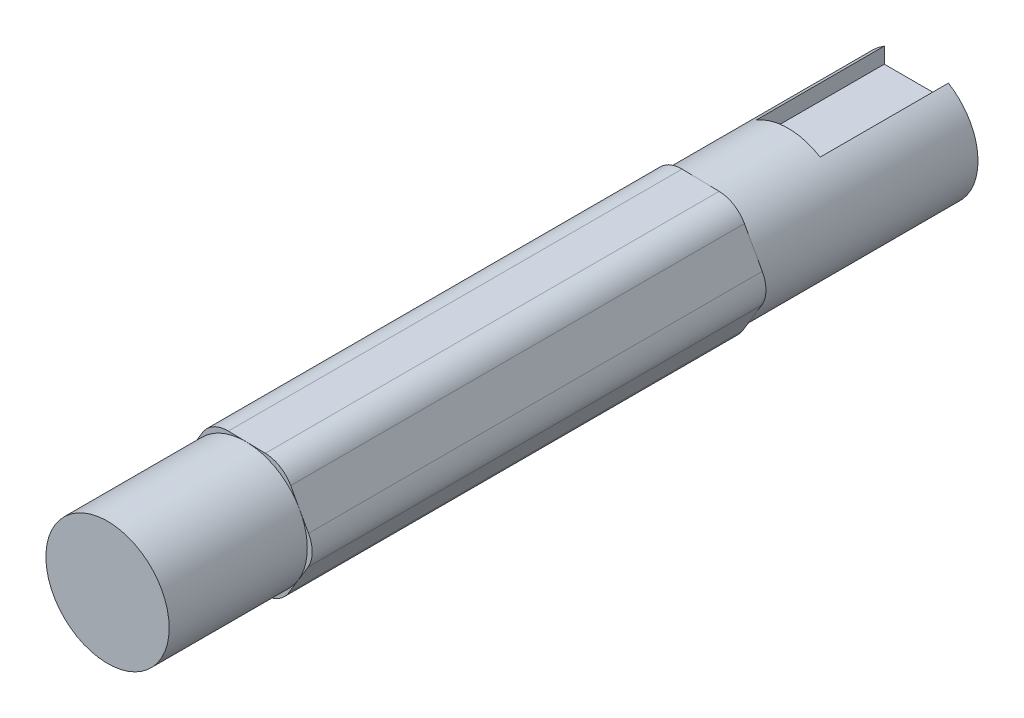
ISO-10303-21;
HEADER;
FILE_DESCRIPTION(('STEP AP214'),'2;1');
FILE_NAME('part.step','',(''),(''),'','','');
FILE_SCHEMA(('AUTOMOTIVE_DESIGN { 1 0 10303 214 1 1 1 1 }'));
ENDSEC;
DATA;
#1=APPLICATION_CONTEXT('core data for automotive mechanical design processes');
#2=APPLICATION_PROTOCOL_DEFINITION('international standard','automotive_design',2000,#1);
#3=PRODUCT_CONTEXT('',#1,'mechanical');
#4=PRODUCT('Part','Part','',(#3));
#5=PRODUCT_RELATED_PRODUCT_CATEGORY('part','',(#4));
#6=PRODUCT_DEFINITION_FORMATION('','',#4);
#7=PRODUCT_DEFINITION_CONTEXT('part definition',#1,'design');
#8=PRODUCT_DEFINITION('design','',#6,#7);
#9=PRODUCT_DEFINITION_SHAPE('','',#8);
#10=(LENGTH_UNIT() NAMED_UNIT(*) SI_UNIT(.MILLI.,.METRE.));
#11=(NAMED_UNIT(*) PLANE_ANGLE_UNIT() SI_UNIT($,.RADIAN.));
#12=(NAMED_UNIT(*) SI_UNIT($,.STERADIAN.) SOLID_ANGLE_UNIT());
#13=UNCERTAINTY_MEASURE_WITH_UNIT(LENGTH_MEASURE(1.E-05),#10,'distance_accuracy_value','');
#14=(GEOMETRIC_REPRESENTATION_CONTEXT(3) GLOBAL_UNCERTAINTY_ASSIGNED_CONTEXT((#13)) GLOBAL_UNIT_ASSIGNED_CONTEXT((#10,
#11,#12)) REPRESENTATION_CONTEXT('',''));
#15=CARTESIAN_POINT('',(0.,0.,0.));
#16=DIRECTION('',(0.,0.,1.));
#17=DIRECTION('',(1.,0.,0.));
#18=AXIS2_PLACEMENT_3D('',#15,#16,#17);
#19=CARTESIAN_POINT('',(0.,0.,-45.));
#20=DIRECTION('',(0.,0.,1.));
#21=DIRECTION('',(1.,0.,0.));
#22=AXIS2_PLACEMENT_3D('',#19,#20,#21);
#23=CYLINDRICAL_SURFACE('',#22,6.25);
#24=DIRECTION('',(0.,0.,1.));
#25=VECTOR('',#24,1.);
#26=CARTESIAN_POINT('',(3.25,5.33853912601566,-45.));
#27=LINE('',#26,#25);
#28=CARTESIAN_POINT('',(3.25,5.33853912601566,-32.));
#29=VERTEX_POINT('',#28);
#30=CARTESIAN_POINT('',(3.25,5.33853912601566,-45.));
#31=VERTEX_POINT('',#30);
#32=EDGE_CURVE('E268',#29,#31,#27,.F.);
#33=ORIENTED_EDGE('',*,*,#32,.F.);
#34=CARTESIAN_POINT('',(0.,0.,-32.));
#35=DIRECTION('',(0.,0.,-1.));
#36=DIRECTION('',(-1.,0.,0.));
#37=AXIS2_PLACEMENT_3D('',#34,#35,#36);
#38=CIRCLE('',#37,6.25);
#39=CARTESIAN_POINT('',(-3.25,5.33853912601566,-32.));
#40=VERTEX_POINT('',#39);
#41=EDGE_CURVE('E228',#29,#40,#38,.F.);
#42=ORIENTED_EDGE('',*,*,#41,.T.);
#43=DIRECTION('',(0.,0.,1.));
#44=VECTOR('',#43,1.);
#45=CARTESIAN_POINT('',(-3.25,5.33853912601566,-45.));
#46=LINE('',#45,#44);
#47=CARTESIAN_POINT('',(-3.25,5.33853912601566,-45.));
#48=VERTEX_POINT('',#47);
#49=EDGE_CURVE('E263',#48,#40,#46,.T.);
#50=ORIENTED_EDGE('',*,*,#49,.F.);
#51=CARTESIAN_POINT('',(0.,0.,-45.));
#52=DIRECTION('',(0.,0.,1.));
#53=DIRECTION('',(1.,0.,0.));
#54=AXIS2_PLACEMENT_3D('',#51,#52,#53);
#55=CIRCLE('',#54,6.25);
#56=EDGE_CURVE('E275',#48,#31,#55,.T.);
#57=ORIENTED_EDGE('',*,*,#56,.T.);
#58=EDGE_LOOP('',(#33,#42,#50,#57));
#59=FACE_BOUND('',#58,.T.);
#60=CARTESIAN_POINT('',(0.,0.,-23.));
#61=DIRECTION('',(0.,0.,1.));
#62=DIRECTION('',(1.,0.,0.));
#63=AXIS2_PLACEMENT_3D('',#60,#61,#62);
#64=CIRCLE('',#63,6.25);
#65=CARTESIAN_POINT('',(5.4741641454902,3.01596202035596,-23.));
#66=VERTEX_POINT('',#65);
#67=CARTESIAN_POINT('',(5.3489817992224,-3.23278420430247,-23.));
#68=VERTEX_POINT('',#67);
#69=EDGE_CURVE('E218',#66,#68,#64,.F.);
#70=ORIENTED_EDGE('',*,*,#69,.T.);
#71=CARTESIAN_POINT('',(-0.125182346267797,-6.24874622465843,-23.));
#72=VERTEX_POINT('',#71);
#73=EDGE_CURVE('E290',#68,#72,#64,.F.);
#74=ORIENTED_EDGE('',*,*,#73,.T.);
#75=CARTESIAN_POINT('',(-5.4741641454902,-3.01596202035596,-23.));
#76=VERTEX_POINT('',#75);
#77=EDGE_CURVE('E361',#72,#76,#64,.F.);
#78=ORIENTED_EDGE('',*,*,#77,.T.);
#79=CARTESIAN_POINT('',(-5.3489817992224,3.23278420430246,-23.));
#80=VERTEX_POINT('',#79);
#81=EDGE_CURVE('E364',#76,#80,#64,.F.);
#82=ORIENTED_EDGE('',*,*,#81,.T.);
#83=CARTESIAN_POINT('',(0.125182346267797,6.24874622465842,-23.));
#84=VERTEX_POINT('',#83);
#85=EDGE_CURVE('E367',#80,#84,#64,.F.);
#86=ORIENTED_EDGE('',*,*,#85,.T.);
#87=EDGE_CURVE('E289',#84,#66,#64,.F.);
#88=ORIENTED_EDGE('',*,*,#87,.T.);
#89=EDGE_LOOP('',(#70,#74,#78,#82,#86,#88));
#90=FACE_BOUND('',#89,.T.);
#91=ADVANCED_FACE('F39',(#59,#90),#23,.T.);
#92=CARTESIAN_POINT('',(0.,0.,-45.));
#93=DIRECTION('',(0.,0.,1.));
#94=DIRECTION('',(1.,0.,0.));
#95=AXIS2_PLACEMENT_3D('',#92,#93,#94);
#96=PLANE('',#95);
#97=DIRECTION('',(-1.,0.,0.));
#98=VECTOR('',#97,1.);
#99=CARTESIAN_POINT('',(3.25,3.75,-45.));
#100=LINE('',#99,#98);
#101=CARTESIAN_POINT('',(3.25,3.75,-45.));
#102=VERTEX_POINT('',#101);
#103=CARTESIAN_POINT('',(-3.25,3.75,-45.));
#104=VERTEX_POINT('',#103);
#105=EDGE_CURVE('E253',#102,#104,#100,.T.);
#106=ORIENTED_EDGE('',*,*,#105,.F.);
#107=DIRECTION('',(0.,1.,0.));
#108=VECTOR('',#107,1.);
#109=CARTESIAN_POINT('',(3.25,0.,-45.));
#110=LINE('',#109,#108);
#111=EDGE_CURVE('E279',#102,#31,#110,.T.);
#112=ORIENTED_EDGE('',*,*,#111,.T.);
#113=ORIENTED_EDGE('',*,*,#56,.F.);
#114=DIRECTION('',(0.,1.,0.));
#115=VECTOR('',#114,1.);
#116=CARTESIAN_POINT('',(-3.25,8.75,-45.));
#117=LINE('',#116,#115);
#118=EDGE_CURVE('E244',#104,#48,#117,.T.);
#119=ORIENTED_EDGE('',*,*,#118,.F.);
#120=EDGE_LOOP('',(#106,#112,#113,#119));
#121=FACE_BOUND('',#120,.T.);
#122=ADVANCED_FACE('F515',(#121),#96,.F.);
#123=CARTESIAN_POINT('',(3.25,8.75,-32.));
#124=DIRECTION('',(1.,0.,0.));
#125=DIRECTION('',(0.,0.,-1.));
#126=AXIS2_PLACEMENT_3D('',#123,#124,#125);
#127=PLANE('',#126);
#128=ORIENTED_EDGE('',*,*,#32,.T.);
#129=ORIENTED_EDGE('',*,*,#111,.F.);
#130=DIRECTION('',(0.,0.,-1.));
#131=VECTOR('',#130,1.);
#132=CARTESIAN_POINT('',(3.25,3.75,-32.));
#133=LINE('',#132,#131);
#134=CARTESIAN_POINT('',(3.25,3.75,-32.));
#135=VERTEX_POINT('',#134);
#136=EDGE_CURVE('E252',#135,#102,#133,.T.);
#137=ORIENTED_EDGE('',*,*,#136,.F.);
#138=DIRECTION('',(0.,-1.,0.));
#139=VECTOR('',#138,1.);
#140=CARTESIAN_POINT('',(3.25,8.75,-32.));
#141=LINE('',#140,#139);
#142=EDGE_CURVE('E240',#29,#135,#141,.T.);
#143=ORIENTED_EDGE('',*,*,#142,.F.);
#144=EDGE_LOOP('',(#128,#129,#137,#143));
#145=FACE_BOUND('',#144,.T.);
#146=ADVANCED_FACE('F521',(#145),#127,.F.);
#147=CARTESIAN_POINT('',(-3.25,8.75,-32.));
#148=DIRECTION('',(-1.,0.,0.));
#149=DIRECTION('',(0.,0.,1.));
#150=AXIS2_PLACEMENT_3D('',#147,#148,#149);
#151=PLANE('',#150);
#152=ORIENTED_EDGE('',*,*,#49,.T.);
#153=DIRECTION('',(0.,1.,0.));
#154=VECTOR('',#153,1.);
#155=CARTESIAN_POINT('',(-3.25,8.75,-32.));
#156=LINE('',#155,#154);
#157=CARTESIAN_POINT('',(-3.25,3.75,-32.));
#158=VERTEX_POINT('',#157);
#159=EDGE_CURVE('E248',#158,#40,#156,.T.);
#160=ORIENTED_EDGE('',*,*,#159,.F.);
#161=DIRECTION('',(0.,0.,-1.));
#162=VECTOR('',#161,1.);
#163=CARTESIAN_POINT('',(-3.25,3.75,-32.));
#164=LINE('',#163,#162);
#165=EDGE_CURVE('E260',#158,#104,#164,.T.);
#166=ORIENTED_EDGE('',*,*,#165,.T.);
#167=ORIENTED_EDGE('',*,*,#118,.T.);
#168=EDGE_LOOP('',(#152,#160,#166,#167));
#169=FACE_BOUND('',#168,.T.);
#170=ADVANCED_FACE('F540',(#169),#151,.F.);
#171=CARTESIAN_POINT('',(3.25,3.75,-32.));
#172=DIRECTION('',(0.,-1.,0.));
#173=DIRECTION('',(0.,0.,-1.));
#174=AXIS2_PLACEMENT_3D('',#171,#172,#173);
#175=PLANE('',#174);
#176=ORIENTED_EDGE('',*,*,#105,.T.);
#177=ORIENTED_EDGE('',*,*,#165,.F.);
#178=DIRECTION('',(-1.,0.,0.));
#179=VECTOR('',#178,1.);
#180=CARTESIAN_POINT('',(3.25,3.75,-32.));
#181=LINE('',#180,#179);
#182=EDGE_CURVE('E243',#135,#158,#181,.T.);
#183=ORIENTED_EDGE('',*,*,#182,.F.);
#184=ORIENTED_EDGE('',*,*,#136,.T.);
#185=EDGE_LOOP('',(#176,#177,#183,#184));
#186=FACE_BOUND('',#185,.T.);
#187=ADVANCED_FACE('F542',(#186),#175,.F.);
#188=CARTESIAN_POINT('',(0.,0.,-32.));
#189=DIRECTION('',(0.,0.,-1.));
#190=DIRECTION('',(-1.,0.,0.));
#191=AXIS2_PLACEMENT_3D('',#188,#189,#190);
#192=PLANE('',#191);
#193=ORIENTED_EDGE('',*,*,#142,.T.);
#194=ORIENTED_EDGE('',*,*,#182,.T.);
#195=ORIENTED_EDGE('',*,*,#159,.T.);
#196=ORIENTED_EDGE('',*,*,#41,.F.);
#197=EDGE_LOOP('',(#193,#194,#195,#196));
#198=FACE_BOUND('',#197,.T.);
#199=ADVANCED_FACE('F545',(#198),#192,.T.);
#200=CARTESIAN_POINT('',(7.2154306298084,-0.144548122631006,42.1851751755642));
#201=DIRECTION('',(-0.875866263278431,-0.482553923256953,0.));
#202=DIRECTION('',(0.482553923256953,-0.875866263278431,0.));
#203=AXIS2_PLACEMENT_3D('',#200,#201,#202);
#204=PLANE('',#203);
#205=DIRECTION('',(-0.482553923256953,0.875866263278431,0.));
#206=VECTOR('',#205,1.);
#207=CARTESIAN_POINT('',(7.2154306298084,-0.144548122631006,23.));
#208=LINE('',#207,#206);
#209=CARTESIAN_POINT('',(6.37962271733566,1.37249674600274,23.));
#210=VERTEX_POINT('',#209);
#211=CARTESIAN_POINT('',(5.4741641454902,3.01596202035596,23.));
#212=VERTEX_POINT('',#211);
#213=EDGE_CURVE('E225',#210,#212,#208,.T.);
#214=ORIENTED_EDGE('',*,*,#213,.F.);
#215=DIRECTION('',(0.,0.,-1.));
#216=VECTOR('',#215,1.);
#217=CARTESIAN_POINT('',(6.37962271733566,1.37249674600274,42.1851751755642));
#218=LINE('',#217,#216);
#219=CARTESIAN_POINT('',(6.37962271733566,1.37249674600274,-23.));
#220=VERTEX_POINT('',#219);
#221=EDGE_CURVE('E350',#210,#220,#218,.T.);
#222=ORIENTED_EDGE('',*,*,#221,.T.);
#223=DIRECTION('',(-0.482553923256953,0.875866263278431,0.));
#224=VECTOR('',#223,1.);
#225=CARTESIAN_POINT('',(7.2154306298084,-0.144548122631006,-23.));
#226=LINE('',#225,#224);
#227=EDGE_CURVE('E429',#220,#66,#226,.T.);
#228=ORIENTED_EDGE('',*,*,#227,.T.);
#229=CARTESIAN_POINT('',(4.56870557364473,4.65942729470918,-23.));
#230=VERTEX_POINT('',#229);
#231=EDGE_CURVE('E433',#66,#230,#226,.T.);
#232=ORIENTED_EDGE('',*,*,#231,.T.);
#233=DIRECTION('',(0.,0.,-1.));
#234=VECTOR('',#233,1.);
#235=CARTESIAN_POINT('',(4.56870557364473,4.65942729470918,42.1851751755642));
#236=LINE('',#235,#234);
#237=CARTESIAN_POINT('',(4.56870557364473,4.65942729470918,23.));
#238=VERTEX_POINT('',#237);
#239=EDGE_CURVE('E347',#230,#238,#236,.F.);
#240=ORIENTED_EDGE('',*,*,#239,.T.);
#241=EDGE_CURVE('E202',#212,#238,#208,.T.);
#242=ORIENTED_EDGE('',*,*,#241,.F.);
#243=EDGE_LOOP('',(#214,#222,#228,#232,#240,#242));
#244=FACE_BOUND('',#243,.T.);
#245=ADVANCED_FACE('F437',(#244),#204,.F.);
#246=CARTESIAN_POINT('',(3.732897661172,6.17647216334292,42.1851751755642));
#247=DIRECTION('',(-0.0200291754028475,-0.999799395945348,0.));
#248=DIRECTION('',(0.999799395945348,-0.0200291754028475,0.));
#249=AXIS2_PLACEMENT_3D('',#246,#247,#248);
#250=PLANE('',#249);
#251=DIRECTION('',(-0.999799395945348,0.0200291754028475,0.));
#252=VECTOR('',#251,1.);
#253=CARTESIAN_POINT('',(3.732897661172,6.17647216334292,-23.));
#254=LINE('',#253,#252);
#255=CARTESIAN_POINT('',(-1.75082961748238,6.28632873654248,-23.));
#256=VERTEX_POINT('',#255);
#257=EDGE_CURVE('E422',#84,#256,#254,.T.);
#258=ORIENTED_EDGE('',*,*,#257,.T.);
#259=DIRECTION('',(0.,0.,-1.));
#260=VECTOR('',#259,1.);
#261=CARTESIAN_POINT('',(-1.75082961748238,6.28632873654248,42.1851751755642));
#262=LINE('',#261,#260);
#263=CARTESIAN_POINT('',(-1.75082961748238,6.28632873654248,23.));
#264=VERTEX_POINT('',#263);
#265=EDGE_CURVE('E305',#256,#264,#262,.F.);
#266=ORIENTED_EDGE('',*,*,#265,.T.);
#267=DIRECTION('',(-0.999799395945348,0.0200291754028475,0.));
#268=VECTOR('',#267,1.);
#269=CARTESIAN_POINT('',(3.732897661172,6.17647216334292,23.));
#270=LINE('',#269,#268);
#271=CARTESIAN_POINT('',(0.125182346267797,6.24874622465842,23.));
#272=VERTEX_POINT('',#271);
#273=EDGE_CURVE('E398',#272,#264,#270,.T.);
#274=ORIENTED_EDGE('',*,*,#273,.F.);
#275=CARTESIAN_POINT('',(2.00119431001798,6.21116371277436,23.));
#276=VERTEX_POINT('',#275);
#277=EDGE_CURVE('E396',#276,#272,#270,.T.);
#278=ORIENTED_EDGE('',*,*,#277,.F.);
#279=DIRECTION('',(0.,0.,-1.));
#280=VECTOR('',#279,1.);
#281=CARTESIAN_POINT('',(2.00119431001798,6.21116371277436,42.1851751755642));
#282=LINE('',#281,#280);
#283=CARTESIAN_POINT('',(2.00119431001798,6.21116371277436,-23.));
#284=VERTEX_POINT('',#283);
#285=EDGE_CURVE('E301',#276,#284,#282,.T.);
#286=ORIENTED_EDGE('',*,*,#285,.T.);
#287=EDGE_CURVE('E415',#284,#84,#254,.T.);
#288=ORIENTED_EDGE('',*,*,#287,.T.);
#289=EDGE_LOOP('',(#258,#266,#274,#278,#286,#288));
#290=FACE_BOUND('',#289,.T.);
#291=ADVANCED_FACE('F414',(#290),#250,.F.);
#292=CARTESIAN_POINT('',(-3.4825329686364,6.32102028597393,42.1851751755642));
#293=DIRECTION('',(0.855837087875584,-0.517245472688394,0.));
#294=DIRECTION('',(0.517245472688394,0.855837087875584,0.));
#295=AXIS2_PLACEMENT_3D('',#292,#293,#294);
#296=PLANE('',#295);
#297=DIRECTION('',(-0.517245472688394,-0.855837087875584,0.));
#298=VECTOR('',#297,1.);
#299=CARTESIAN_POINT('',(-3.4825329686364,6.32102028597393,23.));
#300=LINE('',#299,#298);
#301=CARTESIAN_POINT('',(-4.37842840731768,4.83866696677162,23.));
#302=VERTEX_POINT('',#301);
#303=CARTESIAN_POINT('',(-5.3489817992224,3.23278420430246,23.));
#304=VERTEX_POINT('',#303);
#305=EDGE_CURVE('E390',#302,#304,#300,.T.);
#306=ORIENTED_EDGE('',*,*,#305,.F.);
#307=DIRECTION('',(0.,0.,-1.));
#308=VECTOR('',#307,1.);
#309=CARTESIAN_POINT('',(-4.37842840731768,4.83866696677162,42.1851751755642));
#310=LINE('',#309,#308);
#311=CARTESIAN_POINT('',(-4.37842840731768,4.83866696677162,-23.));
#312=VERTEX_POINT('',#311);
#313=EDGE_CURVE('E294',#302,#312,#310,.T.);
#314=ORIENTED_EDGE('',*,*,#313,.T.);
#315=DIRECTION('',(-0.517245472688394,-0.855837087875584,0.));
#316=VECTOR('',#315,1.);
#317=CARTESIAN_POINT('',(-3.4825329686364,6.32102028597393,-23.));
#318=LINE('',#317,#316);
#319=EDGE_CURVE('E427',#312,#80,#318,.T.);
#320=ORIENTED_EDGE('',*,*,#319,.T.);
#321=CARTESIAN_POINT('',(-6.31953519112712,1.6269014418333,-23.));
#322=VERTEX_POINT('',#321);
#323=EDGE_CURVE('E421',#80,#322,#318,.T.);
#324=ORIENTED_EDGE('',*,*,#323,.T.);
#325=DIRECTION('',(0.,0.,-1.));
#326=VECTOR('',#325,1.);
#327=CARTESIAN_POINT('',(-6.31953519112712,1.6269014418333,42.1851751755642));
#328=LINE('',#327,#326);
#329=CARTESIAN_POINT('',(-6.31953519112712,1.62690144183331,23.));
#330=VERTEX_POINT('',#329);
#331=EDGE_CURVE('E291',#322,#330,#328,.F.);
#332=ORIENTED_EDGE('',*,*,#331,.T.);
#333=EDGE_CURVE('E392',#304,#330,#300,.T.);
#334=ORIENTED_EDGE('',*,*,#333,.F.);
#335=EDGE_LOOP('',(#306,#314,#320,#324,#332,#334));
#336=FACE_BOUND('',#335,.T.);
#337=ADVANCED_FACE('F452',(#336),#296,.F.);
#338=CARTESIAN_POINT('',(-7.2154306298084,0.144548122631005,42.1851751755642));
#339=DIRECTION('',(0.875866263278431,0.482553923256953,0.));
#340=DIRECTION('',(-0.482553923256953,0.875866263278431,0.));
#341=AXIS2_PLACEMENT_3D('',#338,#339,#340);
#342=PLANE('',#341);
#343=DIRECTION('',(0.482553923256953,-0.875866263278431,0.));
#344=VECTOR('',#343,1.);
#345=CARTESIAN_POINT('',(-7.2154306298084,0.144548122631005,23.));
#346=LINE('',#345,#344);
#347=CARTESIAN_POINT('',(-6.37962271733566,-1.37249674600274,23.));
#348=VERTEX_POINT('',#347);
#349=CARTESIAN_POINT('',(-5.4741641454902,-3.01596202035596,23.));
#350=VERTEX_POINT('',#349);
#351=EDGE_CURVE('E384',#348,#350,#346,.T.);
#352=ORIENTED_EDGE('',*,*,#351,.F.);
#353=DIRECTION('',(0.,0.,-1.));
#354=VECTOR('',#353,1.);
#355=CARTESIAN_POINT('',(-6.37962271733566,-1.37249674600274,42.1851751755642));
#356=LINE('',#355,#354);
#357=CARTESIAN_POINT('',(-6.37962271733566,-1.37249674600274,-23.));
#358=VERTEX_POINT('',#357);
#359=EDGE_CURVE('E314',#348,#358,#356,.T.);
#360=ORIENTED_EDGE('',*,*,#359,.T.);
#361=DIRECTION('',(0.482553923256953,-0.875866263278431,0.));
#362=VECTOR('',#361,1.);
#363=CARTESIAN_POINT('',(-7.2154306298084,0.144548122631005,-23.));
#364=LINE('',#363,#362);
#365=EDGE_CURVE('E487',#358,#76,#364,.T.);
#366=ORIENTED_EDGE('',*,*,#365,.T.);
#367=CARTESIAN_POINT('',(-4.56870557364473,-4.65942729470918,-23.));
#368=VERTEX_POINT('',#367);
#369=EDGE_CURVE('E489',#76,#368,#364,.T.);
#370=ORIENTED_EDGE('',*,*,#369,.T.);
#371=DIRECTION('',(0.,0.,-1.));
#372=VECTOR('',#371,1.);
#373=CARTESIAN_POINT('',(-4.56870557364473,-4.65942729470918,42.1851751755642));
#374=LINE('',#373,#372);
#375=CARTESIAN_POINT('',(-4.56870557364473,-4.65942729470918,23.));
#376=VERTEX_POINT('',#375);
#377=EDGE_CURVE('E311',#368,#376,#374,.F.);
#378=ORIENTED_EDGE('',*,*,#377,.T.);
#379=EDGE_CURVE('E386',#350,#376,#346,.T.);
#380=ORIENTED_EDGE('',*,*,#379,.F.);
#381=EDGE_LOOP('',(#352,#360,#366,#370,#378,#380));
#382=FACE_BOUND('',#381,.T.);
#383=ADVANCED_FACE('F463',(#382),#342,.F.);
#384=CARTESIAN_POINT('',(-3.73289766117199,-6.17647216334292,42.1851751755642));
#385=DIRECTION('',(0.0200291754028475,0.999799395945348,0.));
#386=DIRECTION('',(-0.999799395945348,0.0200291754028475,0.));
#387=AXIS2_PLACEMENT_3D('',#384,#385,#386);
#388=PLANE('',#387);
#389=DIRECTION('',(0.999799395945348,-0.0200291754028475,0.));
#390=VECTOR('',#389,1.);
#391=CARTESIAN_POINT('',(-3.73289766117199,-6.17647216334292,23.));
#392=LINE('',#391,#390);
#393=CARTESIAN_POINT('',(-2.00119431001798,-6.21116371277436,23.));
#394=VERTEX_POINT('',#393);
#395=CARTESIAN_POINT('',(-0.125182346267797,-6.24874622465843,23.));
#396=VERTEX_POINT('',#395);
#397=EDGE_CURVE('E257',#394,#396,#392,.T.);
#398=ORIENTED_EDGE('',*,*,#397,.F.);
#399=DIRECTION('',(0.,0.,-1.));
#400=VECTOR('',#399,1.);
#401=CARTESIAN_POINT('',(-2.00119431001798,-6.21116371277436,42.1851751755642));
#402=LINE('',#401,#400);
#403=CARTESIAN_POINT('',(-2.00119431001798,-6.21116371277436,-23.));
#404=VERTEX_POINT('',#403);
#405=EDGE_CURVE('E327',#394,#404,#402,.T.);
#406=ORIENTED_EDGE('',*,*,#405,.T.);
#407=DIRECTION('',(0.999799395945348,-0.0200291754028475,0.));
#408=VECTOR('',#407,1.);
#409=CARTESIAN_POINT('',(-3.73289766117199,-6.17647216334292,-23.));
#410=LINE('',#409,#408);
#411=EDGE_CURVE('E477',#404,#72,#410,.T.);
#412=ORIENTED_EDGE('',*,*,#411,.T.);
#413=CARTESIAN_POINT('',(1.75082961748239,-6.28632873654249,-23.));
#414=VERTEX_POINT('',#413);
#415=EDGE_CURVE('E483',#72,#414,#410,.T.);
#416=ORIENTED_EDGE('',*,*,#415,.T.);
#417=DIRECTION('',(0.,0.,-1.));
#418=VECTOR('',#417,1.);
#419=CARTESIAN_POINT('',(1.75082961748239,-6.28632873654249,42.1851751755642));
#420=LINE('',#419,#418);
#421=CARTESIAN_POINT('',(1.75082961748239,-6.28632873654249,23.));
#422=VERTEX_POINT('',#421);
#423=EDGE_CURVE('E324',#414,#422,#420,.F.);
#424=ORIENTED_EDGE('',*,*,#423,.T.);
#425=EDGE_CURVE('E381',#396,#422,#392,.T.);
#426=ORIENTED_EDGE('',*,*,#425,.F.);
#427=EDGE_LOOP('',(#398,#406,#412,#416,#424,#426));
#428=FACE_BOUND('',#427,.T.);
#429=ADVANCED_FACE('F475',(#428),#388,.F.);
#430=CARTESIAN_POINT('',(3.4825329686364,-6.32102028597393,42.1851751755642));
#431=DIRECTION('',(-0.855837087875584,0.517245472688394,0.));
#432=DIRECTION('',(-0.517245472688394,-0.855837087875584,0.));
#433=AXIS2_PLACEMENT_3D('',#430,#431,#432);
#434=PLANE('',#433);
#435=DIRECTION('',(0.517245472688394,0.855837087875584,0.));
#436=VECTOR('',#435,1.);
#437=CARTESIAN_POINT('',(3.4825329686364,-6.32102028597393,23.));
#438=LINE('',#437,#436);
#439=CARTESIAN_POINT('',(4.37842840731768,-4.83866696677163,23.));
#440=VERTEX_POINT('',#439);
#441=CARTESIAN_POINT('',(5.3489817992224,-3.23278420430247,23.));
#442=VERTEX_POINT('',#441);
#443=EDGE_CURVE('E189',#440,#442,#438,.T.);
#444=ORIENTED_EDGE('',*,*,#443,.F.);
#445=DIRECTION('',(0.,0.,-1.));
#446=VECTOR('',#445,1.);
#447=CARTESIAN_POINT('',(4.37842840731768,-4.83866696677163,42.1851751755642));
#448=LINE('',#447,#446);
#449=CARTESIAN_POINT('',(4.37842840731768,-4.83866696677163,-23.));
#450=VERTEX_POINT('',#449);
#451=EDGE_CURVE('E339',#440,#450,#448,.T.);
#452=ORIENTED_EDGE('',*,*,#451,.T.);
#453=DIRECTION('',(0.517245472688394,0.855837087875584,0.));
#454=VECTOR('',#453,1.);
#455=CARTESIAN_POINT('',(3.4825329686364,-6.32102028597393,-23.));
#456=LINE('',#455,#454);
#457=EDGE_CURVE('E233',#450,#68,#456,.T.);
#458=ORIENTED_EDGE('',*,*,#457,.T.);
#459=CARTESIAN_POINT('',(6.31953519112712,-1.62690144183331,-23.));
#460=VERTEX_POINT('',#459);
#461=EDGE_CURVE('E235',#68,#460,#456,.T.);
#462=ORIENTED_EDGE('',*,*,#461,.T.);
#463=DIRECTION('',(0.,0.,-1.));
#464=VECTOR('',#463,1.);
#465=CARTESIAN_POINT('',(6.31953519112712,-1.62690144183331,42.1851751755642));
#466=LINE('',#465,#464);
#467=CARTESIAN_POINT('',(6.31953519112712,-1.62690144183331,23.));
#468=VERTEX_POINT('',#467);
#469=EDGE_CURVE('E231',#460,#468,#466,.F.);
#470=ORIENTED_EDGE('',*,*,#469,.T.);
#471=EDGE_CURVE('E203',#442,#468,#438,.T.);
#472=ORIENTED_EDGE('',*,*,#471,.F.);
#473=EDGE_LOOP('',(#444,#452,#458,#462,#470,#472));
#474=FACE_BOUND('',#473,.T.);
#475=ADVANCED_FACE('F229',(#474),#434,.F.);
#476=CARTESIAN_POINT('',(0.,0.,-23.));
#477=DIRECTION('',(0.,0.,1.));
#478=DIRECTION('',(1.,0.,0.));
#479=AXIS2_PLACEMENT_3D('',#476,#477,#478);
#480=PLANE('',#479);
#481=ORIENTED_EDGE('',*,*,#457,.F.);
#482=CARTESIAN_POINT('',(1.81091714369093,-3.28693054870644,-23.));
#483=DIRECTION('',(0.,0.,1.));
#484=DIRECTION('',(1.,0.,0.));
#485=AXIS2_PLACEMENT_3D('',#482,#483,#484);
#486=CIRCLE('',#485,3.);
#487=EDGE_CURVE('E342',#450,#414,#486,.F.);
#488=ORIENTED_EDGE('',*,*,#487,.T.);
#489=ORIENTED_EDGE('',*,*,#415,.F.);
#490=ORIENTED_EDGE('',*,*,#73,.F.);
#491=EDGE_LOOP('',(#481,#488,#489,#490));
#492=FACE_BOUND('',#491,.T.);
#493=ADVANCED_FACE('F495',(#492),#480,.F.);
#494=ORIENTED_EDGE('',*,*,#411,.F.);
#495=CARTESIAN_POINT('',(-1.94110678380944,-3.21176552493832,-23.));
#496=DIRECTION('',(0.,0.,1.));
#497=DIRECTION('',(1.,0.,0.));
#498=AXIS2_PLACEMENT_3D('',#495,#496,#497);
#499=CIRCLE('',#498,3.);
#500=EDGE_CURVE('E331',#404,#368,#499,.F.);
#501=ORIENTED_EDGE('',*,*,#500,.T.);
#502=ORIENTED_EDGE('',*,*,#369,.F.);
#503=ORIENTED_EDGE('',*,*,#77,.F.);
#504=EDGE_LOOP('',(#494,#501,#502,#503));
#505=FACE_BOUND('',#504,.T.);
#506=ADVANCED_FACE('F480',(#505),#480,.F.);
#507=ORIENTED_EDGE('',*,*,#365,.F.);
#508=CARTESIAN_POINT('',(-3.75202392750037,0.0751650237681212,-23.));
#509=DIRECTION('',(0.,0.,1.));
#510=DIRECTION('',(1.,0.,0.));
#511=AXIS2_PLACEMENT_3D('',#508,#509,#510);
#512=CIRCLE('',#511,3.);
#513=EDGE_CURVE('E318',#358,#322,#512,.F.);
#514=ORIENTED_EDGE('',*,*,#513,.T.);
#515=ORIENTED_EDGE('',*,*,#323,.F.);
#516=ORIENTED_EDGE('',*,*,#81,.F.);
#517=EDGE_LOOP('',(#507,#514,#515,#516));
#518=FACE_BOUND('',#517,.T.);
#519=ADVANCED_FACE('F447',(#518),#480,.F.);
#520=ORIENTED_EDGE('',*,*,#319,.F.);
#521=CARTESIAN_POINT('',(-1.81091714369093,3.28693054870644,-23.));
#522=DIRECTION('',(0.,0.,1.));
#523=DIRECTION('',(1.,0.,0.));
#524=AXIS2_PLACEMENT_3D('',#521,#522,#523);
#525=CIRCLE('',#524,3.);
#526=EDGE_CURVE('E298',#312,#256,#525,.F.);
#527=ORIENTED_EDGE('',*,*,#526,.T.);
#528=ORIENTED_EDGE('',*,*,#257,.F.);
#529=ORIENTED_EDGE('',*,*,#85,.F.);
#530=EDGE_LOOP('',(#520,#527,#528,#529));
#531=FACE_BOUND('',#530,.T.);
#532=ADVANCED_FACE('F444',(#531),#480,.F.);
#533=ORIENTED_EDGE('',*,*,#287,.F.);
#534=CARTESIAN_POINT('',(1.94110678380944,3.21176552493832,-23.));
#535=DIRECTION('',(0.,0.,1.));
#536=DIRECTION('',(1.,0.,0.));
#537=AXIS2_PLACEMENT_3D('',#534,#535,#536);
#538=CIRCLE('',#537,3.);
#539=EDGE_CURVE('E48',#284,#230,#538,.F.);
#540=ORIENTED_EDGE('',*,*,#539,.T.);
#541=ORIENTED_EDGE('',*,*,#231,.F.);
#542=ORIENTED_EDGE('',*,*,#87,.F.);
#543=EDGE_LOOP('',(#533,#540,#541,#542));
#544=FACE_BOUND('',#543,.T.);
#545=ADVANCED_FACE('F418',(#544),#480,.F.);
#546=CARTESIAN_POINT('',(0.,0.,23.));
#547=DIRECTION('',(0.,0.,1.));
#548=DIRECTION('',(1.,0.,0.));
#549=AXIS2_PLACEMENT_3D('',#546,#547,#548);
#550=PLANE('',#549);
#551=ORIENTED_EDGE('',*,*,#425,.T.);
#552=CARTESIAN_POINT('',(1.81091714369093,-3.28693054870644,23.));
#553=DIRECTION('',(0.,0.,1.));
#554=DIRECTION('',(1.,0.,0.));
#555=AXIS2_PLACEMENT_3D('',#552,#553,#554);
#556=CIRCLE('',#555,3.);
#557=EDGE_CURVE('E196',#422,#440,#556,.T.);
#558=ORIENTED_EDGE('',*,*,#557,.T.);
#559=ORIENTED_EDGE('',*,*,#443,.T.);
#560=CARTESIAN_POINT('',(0.,0.,23.));
#561=DIRECTION('',(0.,0.,1.));
#562=DIRECTION('',(1.,0.,0.));
#563=AXIS2_PLACEMENT_3D('',#560,#561,#562);
#564=CIRCLE('',#563,6.25);
#565=EDGE_CURVE('E193',#442,#396,#564,.F.);
#566=ORIENTED_EDGE('',*,*,#565,.T.);
#567=EDGE_LOOP('',(#551,#558,#559,#566));
#568=FACE_BOUND('',#567,.T.);
#569=ADVANCED_FACE('F192',(#568),#550,.T.);
#570=ORIENTED_EDGE('',*,*,#379,.T.);
#571=CARTESIAN_POINT('',(-1.94110678380944,-3.21176552493832,23.));
#572=DIRECTION('',(0.,0.,1.));
#573=DIRECTION('',(1.,0.,0.));
#574=AXIS2_PLACEMENT_3D('',#571,#572,#573);
#575=CIRCLE('',#574,3.);
#576=EDGE_CURVE('E334',#376,#394,#575,.T.);
#577=ORIENTED_EDGE('',*,*,#576,.T.);
#578=ORIENTED_EDGE('',*,*,#397,.T.);
#579=EDGE_CURVE('E216',#396,#350,#564,.F.);
#580=ORIENTED_EDGE('',*,*,#579,.T.);
#581=EDGE_LOOP('',(#570,#577,#578,#580));
#582=FACE_BOUND('',#581,.T.);
#583=ADVANCED_FACE('F468',(#582),#550,.T.);
#584=ORIENTED_EDGE('',*,*,#333,.T.);
#585=CARTESIAN_POINT('',(-3.75202392750037,0.0751650237681212,23.));
#586=DIRECTION('',(0.,0.,1.));
#587=DIRECTION('',(1.,0.,0.));
#588=AXIS2_PLACEMENT_3D('',#585,#586,#587);
#589=CIRCLE('',#588,3.);
#590=EDGE_CURVE('E321',#330,#348,#589,.T.);
#591=ORIENTED_EDGE('',*,*,#590,.T.);
#592=ORIENTED_EDGE('',*,*,#351,.T.);
#593=EDGE_CURVE('E373',#350,#304,#564,.F.);
#594=ORIENTED_EDGE('',*,*,#593,.T.);
#595=EDGE_LOOP('',(#584,#591,#592,#594));
#596=FACE_BOUND('',#595,.T.);
#597=ADVANCED_FACE('F460',(#596),#550,.T.);
#598=ORIENTED_EDGE('',*,*,#273,.T.);
#599=CARTESIAN_POINT('',(-1.81091714369093,3.28693054870644,23.));
#600=DIRECTION('',(0.,0.,1.));
#601=DIRECTION('',(1.,0.,0.));
#602=AXIS2_PLACEMENT_3D('',#599,#600,#601);
#603=CIRCLE('',#602,3.);
#604=EDGE_CURVE('E308',#264,#302,#603,.T.);
#605=ORIENTED_EDGE('',*,*,#604,.T.);
#606=ORIENTED_EDGE('',*,*,#305,.T.);
#607=EDGE_CURVE('E376',#304,#272,#564,.F.);
#608=ORIENTED_EDGE('',*,*,#607,.T.);
#609=EDGE_LOOP('',(#598,#605,#606,#608));
#610=FACE_BOUND('',#609,.T.);
#611=ADVANCED_FACE('F510',(#610),#550,.T.);
#612=ORIENTED_EDGE('',*,*,#241,.T.);
#613=CARTESIAN_POINT('',(1.94110678380944,3.21176552493832,23.));
#614=DIRECTION('',(0.,0.,1.));
#615=DIRECTION('',(1.,0.,0.));
#616=AXIS2_PLACEMENT_3D('',#613,#614,#615);
#617=CIRCLE('',#616,3.);
#618=EDGE_CURVE('E11',#238,#276,#617,.T.);
#619=ORIENTED_EDGE('',*,*,#618,.T.);
#620=ORIENTED_EDGE('',*,*,#277,.T.);
#621=EDGE_CURVE('E227',#272,#212,#564,.F.);
#622=ORIENTED_EDGE('',*,*,#621,.T.);
#623=EDGE_LOOP('',(#612,#619,#620,#622));
#624=FACE_BOUND('',#623,.T.);
#625=ADVANCED_FACE('F406',(#624),#550,.T.);
#626=ORIENTED_EDGE('',*,*,#227,.F.);
#627=CARTESIAN_POINT('',(3.75202392750037,-0.0751650237681236,-23.));
#628=DIRECTION('',(0.,0.,1.));
#629=DIRECTION('',(1.,0.,0.));
#630=AXIS2_PLACEMENT_3D('',#627,#628,#629);
#631=CIRCLE('',#630,3.);
#632=EDGE_CURVE('E62',#220,#460,#631,.F.);
#633=ORIENTED_EDGE('',*,*,#632,.T.);
#634=ORIENTED_EDGE('',*,*,#461,.F.);
#635=ORIENTED_EDGE('',*,*,#69,.F.);
#636=EDGE_LOOP('',(#626,#633,#634,#635));
#637=FACE_BOUND('',#636,.T.);
#638=ADVANCED_FACE('F501',(#637),#480,.F.);
#639=ORIENTED_EDGE('',*,*,#471,.T.);
#640=CARTESIAN_POINT('',(3.75202392750037,-0.0751650237681236,23.));
#641=DIRECTION('',(0.,0.,1.));
#642=DIRECTION('',(1.,0.,0.));
#643=AXIS2_PLACEMENT_3D('',#640,#641,#642);
#644=CIRCLE('',#643,3.);
#645=EDGE_CURVE('E355',#468,#210,#644,.T.);
#646=ORIENTED_EDGE('',*,*,#645,.T.);
#647=ORIENTED_EDGE('',*,*,#213,.T.);
#648=EDGE_CURVE('E212',#212,#442,#564,.F.);
#649=ORIENTED_EDGE('',*,*,#648,.T.);
#650=EDGE_LOOP('',(#639,#646,#647,#649));
#651=FACE_BOUND('',#650,.T.);
#652=ADVANCED_FACE('F222',(#651),#550,.T.);
#653=CARTESIAN_POINT('',(0.,0.,37.));
#654=DIRECTION('',(0.,0.,1.));
#655=DIRECTION('',(1.,0.,0.));
#656=AXIS2_PLACEMENT_3D('',#653,#654,#655);
#657=PLANE('',#656);
#658=CARTESIAN_POINT('',(0.,0.,37.));
#659=DIRECTION('',(0.,0.,1.));
#660=DIRECTION('',(1.,0.,0.));
#661=AXIS2_PLACEMENT_3D('',#658,#659,#660);
#662=CIRCLE('',#661,6.25);
#663=CARTESIAN_POINT('',(6.25,0.,37.));
#664=VERTEX_POINT('',#663);
#665=EDGE_CURVE('E271',#664,#664,#662,.T.);
#666=ORIENTED_EDGE('',*,*,#665,.T.);
#667=EDGE_LOOP('',(#666));
#668=FACE_BOUND('',#667,.T.);
#669=ADVANCED_FACE('F508',(#668),#657,.T.);
#670=ORIENTED_EDGE('',*,*,#565,.F.);
#671=ORIENTED_EDGE('',*,*,#648,.F.);
#672=ORIENTED_EDGE('',*,*,#621,.F.);
#673=ORIENTED_EDGE('',*,*,#607,.F.);
#674=ORIENTED_EDGE('',*,*,#593,.F.);
#675=ORIENTED_EDGE('',*,*,#579,.F.);
#676=EDGE_LOOP('',(#670,#671,#672,#673,#674,#675));
#677=FACE_BOUND('',#676,.T.);
#678=ORIENTED_EDGE('',*,*,#665,.F.);
#679=EDGE_LOOP('',(#678));
#680=FACE_BOUND('',#679,.T.);
#681=ADVANCED_FACE('F209',(#677,#680),#23,.T.);
#682=CARTESIAN_POINT('',(-1.81091714369093,3.28693054870644,42.1851751755642));
#683=DIRECTION('',(0.,0.,-1.));
#684=DIRECTION('',(-1.,0.,0.));
#685=AXIS2_PLACEMENT_3D('',#682,#683,#684);
#686=CYLINDRICAL_SURFACE('',#685,3.);
#687=ORIENTED_EDGE('',*,*,#604,.F.);
#688=ORIENTED_EDGE('',*,*,#265,.F.);
#689=ORIENTED_EDGE('',*,*,#526,.F.);
#690=ORIENTED_EDGE('',*,*,#313,.F.);
#691=EDGE_LOOP('',(#687,#688,#689,#690));
#692=FACE_BOUND('',#691,.T.);
#693=ADVANCED_FACE('F527',(#692),#686,.T.);
#694=CARTESIAN_POINT('',(-3.75202392750037,0.0751650237681212,42.1851751755642));
#695=DIRECTION('',(0.,0.,-1.));
#696=DIRECTION('',(-1.,0.,0.));
#697=AXIS2_PLACEMENT_3D('',#694,#695,#696);
#698=CYLINDRICAL_SURFACE('',#697,3.);
#699=ORIENTED_EDGE('',*,*,#590,.F.);
#700=ORIENTED_EDGE('',*,*,#331,.F.);
#701=ORIENTED_EDGE('',*,*,#513,.F.);
#702=ORIENTED_EDGE('',*,*,#359,.F.);
#703=EDGE_LOOP('',(#699,#700,#701,#702));
#704=FACE_BOUND('',#703,.T.);
#705=ADVANCED_FACE('F456',(#704),#698,.T.);
#706=CARTESIAN_POINT('',(-1.94110678380944,-3.21176552493832,42.1851751755642));
#707=DIRECTION('',(0.,0.,-1.));
#708=DIRECTION('',(-1.,0.,0.));
#709=AXIS2_PLACEMENT_3D('',#706,#707,#708);
#710=CYLINDRICAL_SURFACE('',#709,3.);
#711=ORIENTED_EDGE('',*,*,#576,.F.);
#712=ORIENTED_EDGE('',*,*,#377,.F.);
#713=ORIENTED_EDGE('',*,*,#500,.F.);
#714=ORIENTED_EDGE('',*,*,#405,.F.);
#715=EDGE_LOOP('',(#711,#712,#713,#714));
#716=FACE_BOUND('',#715,.T.);
#717=ADVANCED_FACE('F472',(#716),#710,.T.);
#718=CARTESIAN_POINT('',(1.81091714369093,-3.28693054870644,42.1851751755642));
#719=DIRECTION('',(0.,0.,-1.));
#720=DIRECTION('',(-1.,0.,0.));
#721=AXIS2_PLACEMENT_3D('',#718,#719,#720);
#722=CYLINDRICAL_SURFACE('',#721,3.);
#723=ORIENTED_EDGE('',*,*,#557,.F.);
#724=ORIENTED_EDGE('',*,*,#423,.F.);
#725=ORIENTED_EDGE('',*,*,#487,.F.);
#726=ORIENTED_EDGE('',*,*,#451,.F.);
#727=EDGE_LOOP('',(#723,#724,#725,#726));
#728=FACE_BOUND('',#727,.T.);
#729=ADVANCED_FACE('F498',(#728),#722,.T.);
#730=CARTESIAN_POINT('',(3.75202392750037,-0.0751650237681236,42.1851751755642));
#731=DIRECTION('',(0.,0.,-1.));
#732=DIRECTION('',(-1.,0.,0.));
#733=AXIS2_PLACEMENT_3D('',#730,#731,#732);
#734=CYLINDRICAL_SURFACE('',#733,3.);
#735=ORIENTED_EDGE('',*,*,#645,.F.);
#736=ORIENTED_EDGE('',*,*,#469,.F.);
#737=ORIENTED_EDGE('',*,*,#632,.F.);
#738=ORIENTED_EDGE('',*,*,#221,.F.);
#739=EDGE_LOOP('',(#735,#736,#737,#738));
#740=FACE_BOUND('',#739,.T.);
#741=ADVANCED_FACE('F656',(#740),#734,.T.);
#742=CARTESIAN_POINT('',(1.94110678380944,3.21176552493832,42.1851751755642));
#743=DIRECTION('',(0.,0.,-1.));
#744=DIRECTION('',(-1.,0.,0.));
#745=AXIS2_PLACEMENT_3D('',#742,#743,#744);
#746=CYLINDRICAL_SURFACE('',#745,3.);
#747=ORIENTED_EDGE('',*,*,#618,.F.);
#748=ORIENTED_EDGE('',*,*,#239,.F.);
#749=ORIENTED_EDGE('',*,*,#539,.F.);
#750=ORIENTED_EDGE('',*,*,#285,.F.);
#751=EDGE_LOOP('',(#747,#748,#749,#750));
#752=FACE_BOUND('',#751,.T.);
#753=ADVANCED_FACE('F41',(#752),#746,.T.);
#754=CLOSED_SHELL('',(#91,#122,#146,#170,#187,#199,#245,#291,#337,#383,#429,#475,#493,#506,#519,
#532,#545,#569,#583,#597,#611,#625,#638,#652,#669,#681,#693,#705,#717,#729,#741,#753));
#755=MANIFOLD_SOLID_BREP('B2',#754);
#756=ADVANCED_BREP_SHAPE_REPRESENTATION('',(#18,#755),#14);
#757=SHAPE_DEFINITION_REPRESENTATION(#9,#756);
ENDSEC;
END-ISO-10303-21;
